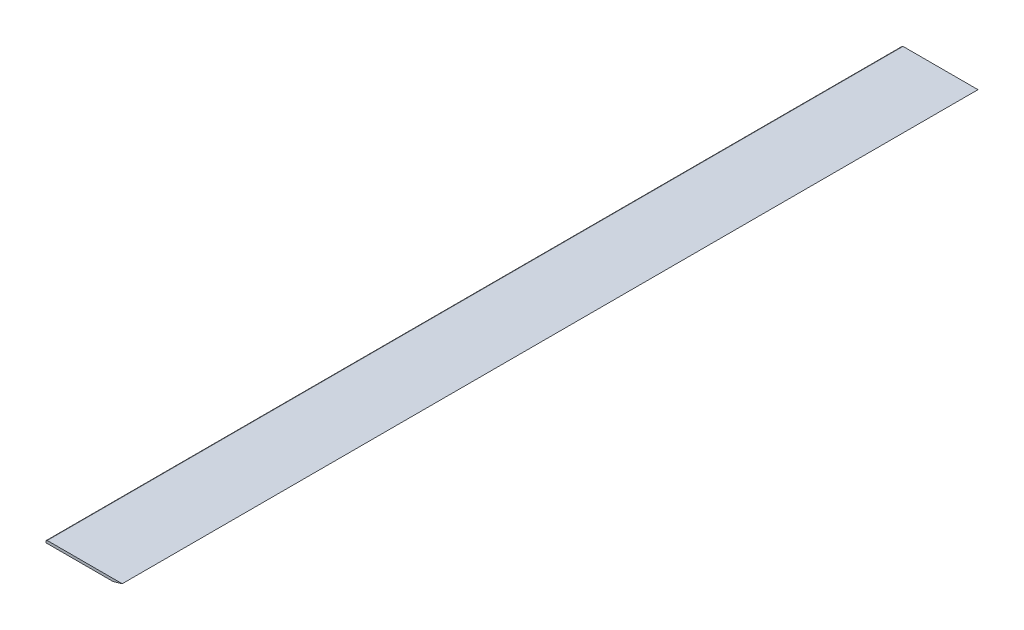
ISO-10303-21;
HEADER;
FILE_DESCRIPTION(('STEP AP214'),'2;1');
FILE_NAME('part.step','',(''),(''),'','','');
FILE_SCHEMA(('AUTOMOTIVE_DESIGN { 1 0 10303 214 1 1 1 1 }'));
ENDSEC;
DATA;
#1=APPLICATION_CONTEXT('core data for automotive mechanical design processes');
#2=APPLICATION_PROTOCOL_DEFINITION('international standard','automotive_design',2000,#1);
#3=PRODUCT_CONTEXT('',#1,'mechanical');
#4=PRODUCT('Part','Part','',(#3));
#5=PRODUCT_RELATED_PRODUCT_CATEGORY('part','',(#4));
#6=PRODUCT_DEFINITION_FORMATION('','',#4);
#7=PRODUCT_DEFINITION_CONTEXT('part definition',#1,'design');
#8=PRODUCT_DEFINITION('design','',#6,#7);
#9=PRODUCT_DEFINITION_SHAPE('','',#8);
#10=(LENGTH_UNIT() NAMED_UNIT(*) SI_UNIT(.MILLI.,.METRE.));
#11=(NAMED_UNIT(*) PLANE_ANGLE_UNIT() SI_UNIT($,.RADIAN.));
#12=(NAMED_UNIT(*) SI_UNIT($,.STERADIAN.) SOLID_ANGLE_UNIT());
#13=UNCERTAINTY_MEASURE_WITH_UNIT(LENGTH_MEASURE(1.E-05),#10,'distance_accuracy_value','');
#14=(GEOMETRIC_REPRESENTATION_CONTEXT(3) GLOBAL_UNCERTAINTY_ASSIGNED_CONTEXT((#13)) GLOBAL_UNIT_ASSIGNED_CONTEXT((#10,
#11,#12)) REPRESENTATION_CONTEXT('',''));
#15=CARTESIAN_POINT('',(0.,0.,0.));
#16=DIRECTION('',(0.,0.,1.));
#17=DIRECTION('',(1.,0.,0.));
#18=AXIS2_PLACEMENT_3D('',#15,#16,#17);
#19=CARTESIAN_POINT('',(0.,0.,0.));
#20=DIRECTION('',(0.,-1.,0.));
#21=DIRECTION('',(0.,0.,-1.));
#22=AXIS2_PLACEMENT_3D('',#19,#20,#21);
#23=PLANE('',#22);
#24=DIRECTION('',(0.,0.,1.));
#25=VECTOR('',#24,1.);
#26=CARTESIAN_POINT('',(0.,0.,0.));
#27=LINE('',#26,#25);
#28=CARTESIAN_POINT('',(0.,0.,0.));
#29=VERTEX_POINT('',#28);
#30=CARTESIAN_POINT('',(0.,0.,2032.));
#31=VERTEX_POINT('',#30);
#32=EDGE_CURVE('E70',#29,#31,#27,.T.);
#33=ORIENTED_EDGE('',*,*,#32,.F.);
#34=DIRECTION('',(1.,0.,0.));
#35=VECTOR('',#34,1.);
#36=CARTESIAN_POINT('',(0.,0.,0.));
#37=LINE('',#36,#35);
#38=CARTESIAN_POINT('',(158.829918281616,0.,0.));
#39=VERTEX_POINT('',#38);
#40=EDGE_CURVE('E98',#29,#39,#37,.T.);
#41=ORIENTED_EDGE('',*,*,#40,.T.);
#42=DIRECTION('',(0.,0.,1.));
#43=VECTOR('',#42,1.);
#44=CARTESIAN_POINT('',(158.829918281616,0.,0.));
#45=LINE('',#44,#43);
#46=CARTESIAN_POINT('',(158.829918281616,0.,2032.));
#47=VERTEX_POINT('',#46);
#48=EDGE_CURVE('E81',#47,#39,#45,.F.);
#49=ORIENTED_EDGE('',*,*,#48,.F.);
#50=DIRECTION('',(1.,0.,0.));
#51=VECTOR('',#50,1.);
#52=CARTESIAN_POINT('',(0.,0.,2032.));
#53=LINE('',#52,#51);
#54=EDGE_CURVE('E79',#31,#47,#53,.T.);
#55=ORIENTED_EDGE('',*,*,#54,.F.);
#56=EDGE_LOOP('',(#33,#41,#49,#55));
#57=FACE_BOUND('',#56,.T.);
#58=ADVANCED_FACE('F16',(#57),#23,.T.);
#59=CARTESIAN_POINT('',(0.,6.35,0.));
#60=DIRECTION('',(-1.,0.,0.));
#61=DIRECTION('',(0.,0.,1.));
#62=AXIS2_PLACEMENT_3D('',#59,#60,#61);
#63=PLANE('',#62);
#64=DIRECTION('',(0.,1.,0.));
#65=VECTOR('',#64,1.);
#66=CARTESIAN_POINT('',(0.,0.,2032.));
#67=LINE('',#66,#65);
#68=CARTESIAN_POINT('',(0.,3.175,2032.));
#69=VERTEX_POINT('',#68);
#70=EDGE_CURVE('E51',#69,#31,#67,.F.);
#71=ORIENTED_EDGE('',*,*,#70,.F.);
#72=DIRECTION('',(0.,0.,-1.));
#73=VECTOR('',#72,1.);
#74=CARTESIAN_POINT('',(0.,3.175,4680.9152));
#75=LINE('',#74,#73);
#76=CARTESIAN_POINT('',(0.,3.175,0.));
#77=VERTEX_POINT('',#76);
#78=EDGE_CURVE('E92',#77,#69,#75,.F.);
#79=ORIENTED_EDGE('',*,*,#78,.F.);
#80=DIRECTION('',(0.,1.,0.));
#81=VECTOR('',#80,1.);
#82=CARTESIAN_POINT('',(0.,0.,0.));
#83=LINE('',#82,#81);
#84=EDGE_CURVE('E73',#77,#29,#83,.F.);
#85=ORIENTED_EDGE('',*,*,#84,.T.);
#86=ORIENTED_EDGE('',*,*,#32,.T.);
#87=EDGE_LOOP('',(#71,#79,#85,#86));
#88=FACE_BOUND('',#87,.T.);
#89=ADVANCED_FACE('F72',(#88),#63,.T.);
#90=CARTESIAN_POINT('',(0.,0.,2032.));
#91=DIRECTION('',(0.,0.,1.));
#92=DIRECTION('',(1.,0.,0.));
#93=AXIS2_PLACEMENT_3D('',#90,#91,#92);
#94=PLANE('',#93);
#95=DIRECTION('',(1.,0.,0.));
#96=VECTOR('',#95,1.);
#97=CARTESIAN_POINT('',(180.975,6.35,2032.));
#98=LINE('',#97,#96);
#99=CARTESIAN_POINT('',(3.17500000000127,6.35,2032.));
#100=VERTEX_POINT('',#99);
#101=CARTESIAN_POINT('',(180.975,6.34999999999953,2032.));
#102=VERTEX_POINT('',#101);
#103=EDGE_CURVE('E57',#100,#102,#98,.T.);
#104=ORIENTED_EDGE('',*,*,#103,.F.);
#105=CARTESIAN_POINT('',(3.175,3.175,2032.));
#106=DIRECTION('',(0.,0.,-1.));
#107=DIRECTION('',(-1.,0.,0.));
#108=AXIS2_PLACEMENT_3D('',#105,#106,#107);
#109=CIRCLE('',#108,3.175);
#110=EDGE_CURVE('E19',#69,#100,#109,.T.);
#111=ORIENTED_EDGE('',*,*,#110,.F.);
#112=ORIENTED_EDGE('',*,*,#70,.T.);
#113=ORIENTED_EDGE('',*,*,#54,.T.);
#114=DIRECTION('',(0.961261695938317,0.275637355817005,0.));
#115=VECTOR('',#114,1.);
#116=CARTESIAN_POINT('',(158.829918281616,0.,2032.));
#117=LINE('',#116,#115);
#118=EDGE_CURVE('E62',#102,#47,#117,.F.);
#119=ORIENTED_EDGE('',*,*,#118,.F.);
#120=EDGE_LOOP('',(#104,#111,#112,#113,#119));
#121=FACE_BOUND('',#120,.T.);
#122=ADVANCED_FACE('F83',(#121),#94,.T.);
#123=CARTESIAN_POINT('',(158.829918281616,0.,0.));
#124=DIRECTION('',(0.275637355817005,-0.961261695938317,0.));
#125=DIRECTION('',(0.961261695938317,0.275637355817005,0.));
#126=AXIS2_PLACEMENT_3D('',#123,#124,#125);
#127=PLANE('',#126);
#128=ORIENTED_EDGE('',*,*,#48,.T.);
#129=DIRECTION('',(0.9612616959383,0.275637355817065,0.));
#130=VECTOR('',#129,1.);
#131=CARTESIAN_POINT('',(158.829918281616,0.,0.));
#132=LINE('',#131,#130);
#133=CARTESIAN_POINT('',(180.975,6.35,0.));
#134=VERTEX_POINT('',#133);
#135=EDGE_CURVE('E94',#39,#134,#132,.T.);
#136=ORIENTED_EDGE('',*,*,#135,.T.);
#137=DIRECTION('',(0.,0.,1.));
#138=VECTOR('',#137,1.);
#139=CARTESIAN_POINT('',(180.975,6.35,0.));
#140=LINE('',#139,#138);
#141=EDGE_CURVE('E106',#102,#134,#140,.F.);
#142=ORIENTED_EDGE('',*,*,#141,.F.);
#143=ORIENTED_EDGE('',*,*,#118,.T.);
#144=EDGE_LOOP('',(#128,#136,#142,#143));
#145=FACE_BOUND('',#144,.T.);
#146=ADVANCED_FACE('F127',(#145),#127,.T.);
#147=CARTESIAN_POINT('',(0.,0.,0.));
#148=DIRECTION('',(0.,0.,1.));
#149=DIRECTION('',(1.,0.,0.));
#150=AXIS2_PLACEMENT_3D('',#147,#148,#149);
#151=PLANE('',#150);
#152=ORIENTED_EDGE('',*,*,#135,.F.);
#153=ORIENTED_EDGE('',*,*,#40,.F.);
#154=ORIENTED_EDGE('',*,*,#84,.F.);
#155=CARTESIAN_POINT('',(3.175,3.175,0.));
#156=DIRECTION('',(0.,0.,-1.));
#157=DIRECTION('',(-1.,0.,0.));
#158=AXIS2_PLACEMENT_3D('',#155,#156,#157);
#159=CIRCLE('',#158,3.175);
#160=CARTESIAN_POINT('',(3.17500000000127,6.35,0.));
#161=VERTEX_POINT('',#160);
#162=EDGE_CURVE('E34',#161,#77,#159,.F.);
#163=ORIENTED_EDGE('',*,*,#162,.F.);
#164=DIRECTION('',(1.,0.,0.));
#165=VECTOR('',#164,1.);
#166=CARTESIAN_POINT('',(180.975,6.35,0.));
#167=LINE('',#166,#165);
#168=EDGE_CURVE('E25',#134,#161,#167,.F.);
#169=ORIENTED_EDGE('',*,*,#168,.F.);
#170=EDGE_LOOP('',(#152,#153,#154,#163,#169));
#171=FACE_BOUND('',#170,.T.);
#172=ADVANCED_FACE('F128',(#171),#151,.F.);
#173=CARTESIAN_POINT('',(3.175,3.175,4680.9152));
#174=DIRECTION('',(0.,0.,-1.));
#175=DIRECTION('',(-1.,0.,0.));
#176=AXIS2_PLACEMENT_3D('',#173,#174,#175);
#177=CYLINDRICAL_SURFACE('',#176,3.175);
#178=DIRECTION('',(0.,0.,1.));
#179=VECTOR('',#178,1.);
#180=CARTESIAN_POINT('',(3.17500000000254,6.35,0.));
#181=LINE('',#180,#179);
#182=EDGE_CURVE('E11',#161,#100,#181,.T.);
#183=ORIENTED_EDGE('',*,*,#182,.F.);
#184=ORIENTED_EDGE('',*,*,#162,.T.);
#185=ORIENTED_EDGE('',*,*,#78,.T.);
#186=ORIENTED_EDGE('',*,*,#110,.T.);
#187=EDGE_LOOP('',(#183,#184,#185,#186));
#188=FACE_BOUND('',#187,.T.);
#189=ADVANCED_FACE('F107',(#188),#177,.T.);
#190=CARTESIAN_POINT('',(180.975,6.35,0.));
#191=DIRECTION('',(0.,1.,0.));
#192=DIRECTION('',(0.,0.,1.));
#193=AXIS2_PLACEMENT_3D('',#190,#191,#192);
#194=PLANE('',#193);
#195=ORIENTED_EDGE('',*,*,#168,.T.);
#196=ORIENTED_EDGE('',*,*,#182,.T.);
#197=ORIENTED_EDGE('',*,*,#103,.T.);
#198=ORIENTED_EDGE('',*,*,#141,.T.);
#199=EDGE_LOOP('',(#195,#196,#197,#198));
#200=FACE_BOUND('',#199,.T.);
#201=ADVANCED_FACE('F110',(#200),#194,.T.);
#202=CLOSED_SHELL('',(#58,#89,#122,#146,#172,#189,#201));
#203=MANIFOLD_SOLID_BREP('B1',#202);
#204=ADVANCED_BREP_SHAPE_REPRESENTATION('',(#18,#203),#14);
#205=SHAPE_DEFINITION_REPRESENTATION(#9,#204);
ENDSEC;
END-ISO-10303-21;
